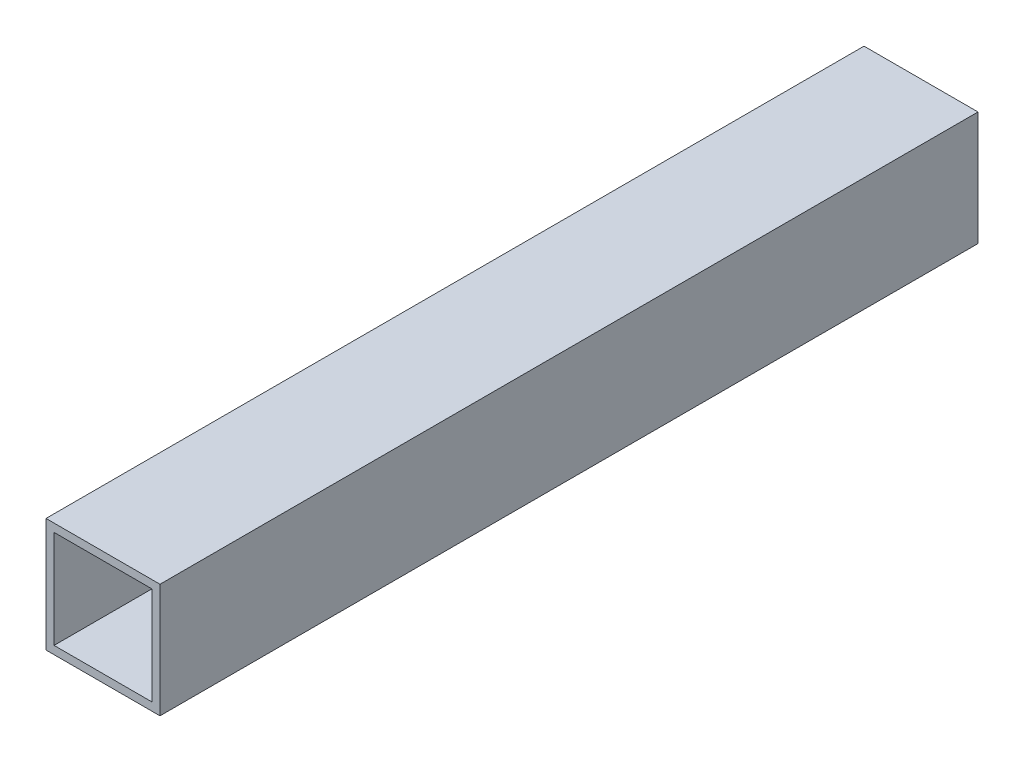
ISO-10303-21;
HEADER;
FILE_DESCRIPTION(('STEP AP214'),'2;1');
FILE_NAME('part.step','',(''),(''),'','','');
FILE_SCHEMA(('AUTOMOTIVE_DESIGN { 1 0 10303 214 1 1 1 1 }'));
ENDSEC;
DATA;
#1=APPLICATION_CONTEXT('core data for automotive mechanical design processes');
#2=APPLICATION_PROTOCOL_DEFINITION('international standard','automotive_design',2000,#1);
#3=PRODUCT_CONTEXT('',#1,'mechanical');
#4=PRODUCT('Part','Part','',(#3));
#5=PRODUCT_RELATED_PRODUCT_CATEGORY('part','',(#4));
#6=PRODUCT_DEFINITION_FORMATION('','',#4);
#7=PRODUCT_DEFINITION_CONTEXT('part definition',#1,'design');
#8=PRODUCT_DEFINITION('design','',#6,#7);
#9=PRODUCT_DEFINITION_SHAPE('','',#8);
#10=(LENGTH_UNIT() NAMED_UNIT(*) SI_UNIT(.MILLI.,.METRE.));
#11=(NAMED_UNIT(*) PLANE_ANGLE_UNIT() SI_UNIT($,.RADIAN.));
#12=(NAMED_UNIT(*) SI_UNIT($,.STERADIAN.) SOLID_ANGLE_UNIT());
#13=UNCERTAINTY_MEASURE_WITH_UNIT(LENGTH_MEASURE(1.E-05),#10,'distance_accuracy_value','');
#14=(GEOMETRIC_REPRESENTATION_CONTEXT(3) GLOBAL_UNCERTAINTY_ASSIGNED_CONTEXT((#13)) GLOBAL_UNIT_ASSIGNED_CONTEXT((#10,
#11,#12)) REPRESENTATION_CONTEXT('',''));
#15=CARTESIAN_POINT('',(0.,0.,0.));
#16=DIRECTION('',(0.,0.,1.));
#17=DIRECTION('',(1.,0.,0.));
#18=AXIS2_PLACEMENT_3D('',#15,#16,#17);
#19=CARTESIAN_POINT('',(0.,0.,122.));
#20=DIRECTION('',(0.,0.,-1.));
#21=DIRECTION('',(-1.,0.,0.));
#22=AXIS2_PLACEMENT_3D('',#19,#20,#21);
#23=PLANE('',#22);
#24=DIRECTION('',(0.,1.,0.));
#25=VECTOR('',#24,1.);
#26=CARTESIAN_POINT('',(8.5,-8.5,122.));
#27=LINE('',#26,#25);
#28=CARTESIAN_POINT('',(8.5,-8.5,122.));
#29=VERTEX_POINT('',#28);
#30=CARTESIAN_POINT('',(8.5,8.5,122.));
#31=VERTEX_POINT('',#30);
#32=EDGE_CURVE('E153',#29,#31,#27,.T.);
#33=ORIENTED_EDGE('',*,*,#32,.T.);
#34=DIRECTION('',(-1.,0.,0.));
#35=VECTOR('',#34,1.);
#36=CARTESIAN_POINT('',(-8.5,8.5,122.));
#37=LINE('',#36,#35);
#38=CARTESIAN_POINT('',(-8.5,8.5,122.));
#39=VERTEX_POINT('',#38);
#40=EDGE_CURVE('E157',#31,#39,#37,.T.);
#41=ORIENTED_EDGE('',*,*,#40,.T.);
#42=DIRECTION('',(0.,-1.,0.));
#43=VECTOR('',#42,1.);
#44=CARTESIAN_POINT('',(-8.5,-8.5,122.));
#45=LINE('',#44,#43);
#46=CARTESIAN_POINT('',(-8.5,-8.5,122.));
#47=VERTEX_POINT('',#46);
#48=EDGE_CURVE('E161',#39,#47,#45,.T.);
#49=ORIENTED_EDGE('',*,*,#48,.T.);
#50=DIRECTION('',(1.,0.,0.));
#51=VECTOR('',#50,1.);
#52=CARTESIAN_POINT('',(-8.5,-8.5,122.));
#53=LINE('',#52,#51);
#54=EDGE_CURVE('E164',#47,#29,#53,.T.);
#55=ORIENTED_EDGE('',*,*,#54,.T.);
#56=EDGE_LOOP('',(#33,#41,#49,#55));
#57=FACE_BOUND('',#56,.T.);
#58=DIRECTION('',(0.,-1.,0.));
#59=VECTOR('',#58,1.);
#60=CARTESIAN_POINT('',(-7.3,-7.3,122.));
#61=LINE('',#60,#59);
#62=CARTESIAN_POINT('',(-7.3,7.3,122.));
#63=VERTEX_POINT('',#62);
#64=CARTESIAN_POINT('',(-7.3,-7.3,122.));
#65=VERTEX_POINT('',#64);
#66=EDGE_CURVE('E105',#63,#65,#61,.T.);
#67=ORIENTED_EDGE('',*,*,#66,.F.);
#68=DIRECTION('',(-1.,0.,0.));
#69=VECTOR('',#68,1.);
#70=CARTESIAN_POINT('',(-7.3,7.3,122.));
#71=LINE('',#70,#69);
#72=CARTESIAN_POINT('',(7.3,7.3,122.));
#73=VERTEX_POINT('',#72);
#74=EDGE_CURVE('E131',#73,#63,#71,.T.);
#75=ORIENTED_EDGE('',*,*,#74,.F.);
#76=DIRECTION('',(0.,1.,0.));
#77=VECTOR('',#76,1.);
#78=CARTESIAN_POINT('',(7.3,-7.3,122.));
#79=LINE('',#78,#77);
#80=CARTESIAN_POINT('',(7.3,-7.3,122.));
#81=VERTEX_POINT('',#80);
#82=EDGE_CURVE('E127',#81,#73,#79,.T.);
#83=ORIENTED_EDGE('',*,*,#82,.F.);
#84=DIRECTION('',(1.,0.,0.));
#85=VECTOR('',#84,1.);
#86=CARTESIAN_POINT('',(-7.3,-7.3,122.));
#87=LINE('',#86,#85);
#88=EDGE_CURVE('E114',#65,#81,#87,.T.);
#89=ORIENTED_EDGE('',*,*,#88,.F.);
#90=EDGE_LOOP('',(#67,#75,#83,#89));
#91=FACE_BOUND('',#90,.T.);
#92=ADVANCED_FACE('F39',(#57,#91),#23,.F.);
#93=CARTESIAN_POINT('',(0.,0.,0.));
#94=DIRECTION('',(0.,0.,-1.));
#95=DIRECTION('',(-1.,0.,0.));
#96=AXIS2_PLACEMENT_3D('',#93,#94,#95);
#97=PLANE('',#96);
#98=DIRECTION('',(0.,1.,0.));
#99=VECTOR('',#98,1.);
#100=CARTESIAN_POINT('',(8.5,-8.5,0.));
#101=LINE('',#100,#99);
#102=CARTESIAN_POINT('',(8.5,-8.5,0.));
#103=VERTEX_POINT('',#102);
#104=CARTESIAN_POINT('',(8.5,8.5,0.));
#105=VERTEX_POINT('',#104);
#106=EDGE_CURVE('E123',#103,#105,#101,.T.);
#107=ORIENTED_EDGE('',*,*,#106,.F.);
#108=DIRECTION('',(1.,0.,0.));
#109=VECTOR('',#108,1.);
#110=CARTESIAN_POINT('',(-8.5,-8.5,0.));
#111=LINE('',#110,#109);
#112=CARTESIAN_POINT('',(-8.5,-8.5,0.));
#113=VERTEX_POINT('',#112);
#114=EDGE_CURVE('E158',#113,#103,#111,.T.);
#115=ORIENTED_EDGE('',*,*,#114,.F.);
#116=DIRECTION('',(0.,-1.,0.));
#117=VECTOR('',#116,1.);
#118=CARTESIAN_POINT('',(-8.5,-8.5,0.));
#119=LINE('',#118,#117);
#120=CARTESIAN_POINT('',(-8.5,8.5,0.));
#121=VERTEX_POINT('',#120);
#122=EDGE_CURVE('E174',#121,#113,#119,.T.);
#123=ORIENTED_EDGE('',*,*,#122,.F.);
#124=DIRECTION('',(-1.,0.,0.));
#125=VECTOR('',#124,1.);
#126=CARTESIAN_POINT('',(-8.5,8.5,0.));
#127=LINE('',#126,#125);
#128=EDGE_CURVE('E171',#105,#121,#127,.T.);
#129=ORIENTED_EDGE('',*,*,#128,.F.);
#130=EDGE_LOOP('',(#107,#115,#123,#129));
#131=FACE_BOUND('',#130,.T.);
#132=DIRECTION('',(-1.,0.,0.));
#133=VECTOR('',#132,1.);
#134=CARTESIAN_POINT('',(-7.3,7.3,0.));
#135=LINE('',#134,#133);
#136=CARTESIAN_POINT('',(7.3,7.3,0.));
#137=VERTEX_POINT('',#136);
#138=CARTESIAN_POINT('',(-7.3,7.3,0.));
#139=VERTEX_POINT('',#138);
#140=EDGE_CURVE('E115',#137,#139,#135,.T.);
#141=ORIENTED_EDGE('',*,*,#140,.T.);
#142=DIRECTION('',(0.,-1.,0.));
#143=VECTOR('',#142,1.);
#144=CARTESIAN_POINT('',(-7.3,-7.3,0.));
#145=LINE('',#144,#143);
#146=CARTESIAN_POINT('',(-7.3,-7.3,0.));
#147=VERTEX_POINT('',#146);
#148=EDGE_CURVE('E63',#139,#147,#145,.T.);
#149=ORIENTED_EDGE('',*,*,#148,.T.);
#150=DIRECTION('',(1.,0.,0.));
#151=VECTOR('',#150,1.);
#152=CARTESIAN_POINT('',(-7.3,-7.3,0.));
#153=LINE('',#152,#151);
#154=CARTESIAN_POINT('',(7.3,-7.3,0.));
#155=VERTEX_POINT('',#154);
#156=EDGE_CURVE('E121',#147,#155,#153,.T.);
#157=ORIENTED_EDGE('',*,*,#156,.T.);
#158=DIRECTION('',(0.,1.,0.));
#159=VECTOR('',#158,1.);
#160=CARTESIAN_POINT('',(7.3,-7.3,0.));
#161=LINE('',#160,#159);
#162=EDGE_CURVE('E140',#155,#137,#161,.T.);
#163=ORIENTED_EDGE('',*,*,#162,.T.);
#164=EDGE_LOOP('',(#141,#149,#157,#163));
#165=FACE_BOUND('',#164,.T.);
#166=ADVANCED_FACE('F197',(#131,#165),#97,.T.);
#167=CARTESIAN_POINT('',(8.5,-8.5,122.));
#168=DIRECTION('',(-1.,0.,0.));
#169=DIRECTION('',(0.,0.,1.));
#170=AXIS2_PLACEMENT_3D('',#167,#168,#169);
#171=PLANE('',#170);
#172=ORIENTED_EDGE('',*,*,#106,.T.);
#173=DIRECTION('',(0.,0.,-1.));
#174=VECTOR('',#173,1.);
#175=CARTESIAN_POINT('',(8.5,8.5,122.));
#176=LINE('',#175,#174);
#177=EDGE_CURVE('E11',#31,#105,#176,.T.);
#178=ORIENTED_EDGE('',*,*,#177,.F.);
#179=ORIENTED_EDGE('',*,*,#32,.F.);
#180=DIRECTION('',(0.,0.,-1.));
#181=VECTOR('',#180,1.);
#182=CARTESIAN_POINT('',(8.5,-8.5,122.));
#183=LINE('',#182,#181);
#184=EDGE_CURVE('E167',#29,#103,#183,.T.);
#185=ORIENTED_EDGE('',*,*,#184,.T.);
#186=EDGE_LOOP('',(#172,#178,#179,#185));
#187=FACE_BOUND('',#186,.T.);
#188=ADVANCED_FACE('F41',(#187),#171,.F.);
#189=CARTESIAN_POINT('',(-8.5,8.5,122.));
#190=DIRECTION('',(0.,-1.,0.));
#191=DIRECTION('',(0.,0.,-1.));
#192=AXIS2_PLACEMENT_3D('',#189,#190,#191);
#193=PLANE('',#192);
#194=ORIENTED_EDGE('',*,*,#128,.T.);
#195=DIRECTION('',(0.,0.,-1.));
#196=VECTOR('',#195,1.);
#197=CARTESIAN_POINT('',(-8.5,8.5,122.));
#198=LINE('',#197,#196);
#199=EDGE_CURVE('E48',#39,#121,#198,.T.);
#200=ORIENTED_EDGE('',*,*,#199,.F.);
#201=ORIENTED_EDGE('',*,*,#40,.F.);
#202=ORIENTED_EDGE('',*,*,#177,.T.);
#203=EDGE_LOOP('',(#194,#200,#201,#202));
#204=FACE_BOUND('',#203,.T.);
#205=ADVANCED_FACE('F207',(#204),#193,.F.);
#206=CARTESIAN_POINT('',(-8.5,-8.5,122.));
#207=DIRECTION('',(1.,0.,0.));
#208=DIRECTION('',(0.,0.,-1.));
#209=AXIS2_PLACEMENT_3D('',#206,#207,#208);
#210=PLANE('',#209);
#211=ORIENTED_EDGE('',*,*,#122,.T.);
#212=DIRECTION('',(0.,0.,-1.));
#213=VECTOR('',#212,1.);
#214=CARTESIAN_POINT('',(-8.5,-8.5,122.));
#215=LINE('',#214,#213);
#216=EDGE_CURVE('E182',#47,#113,#215,.T.);
#217=ORIENTED_EDGE('',*,*,#216,.F.);
#218=ORIENTED_EDGE('',*,*,#48,.F.);
#219=ORIENTED_EDGE('',*,*,#199,.T.);
#220=EDGE_LOOP('',(#211,#217,#218,#219));
#221=FACE_BOUND('',#220,.T.);
#222=ADVANCED_FACE('F191',(#221),#210,.F.);
#223=CARTESIAN_POINT('',(-8.5,-8.5,122.));
#224=DIRECTION('',(0.,1.,0.));
#225=DIRECTION('',(0.,0.,1.));
#226=AXIS2_PLACEMENT_3D('',#223,#224,#225);
#227=PLANE('',#226);
#228=ORIENTED_EDGE('',*,*,#114,.T.);
#229=ORIENTED_EDGE('',*,*,#184,.F.);
#230=ORIENTED_EDGE('',*,*,#54,.F.);
#231=ORIENTED_EDGE('',*,*,#216,.T.);
#232=EDGE_LOOP('',(#228,#229,#230,#231));
#233=FACE_BOUND('',#232,.T.);
#234=ADVANCED_FACE('F201',(#233),#227,.F.);
#235=CARTESIAN_POINT('',(-7.3,-7.3,122.));
#236=DIRECTION('',(1.,0.,0.));
#237=DIRECTION('',(0.,0.,-1.));
#238=AXIS2_PLACEMENT_3D('',#235,#236,#237);
#239=PLANE('',#238);
#240=ORIENTED_EDGE('',*,*,#148,.F.);
#241=DIRECTION('',(0.,0.,-1.));
#242=VECTOR('',#241,1.);
#243=CARTESIAN_POINT('',(-7.3,7.3,122.));
#244=LINE('',#243,#242);
#245=EDGE_CURVE('E109',#63,#139,#244,.T.);
#246=ORIENTED_EDGE('',*,*,#245,.F.);
#247=ORIENTED_EDGE('',*,*,#66,.T.);
#248=DIRECTION('',(0.,0.,-1.));
#249=VECTOR('',#248,1.);
#250=CARTESIAN_POINT('',(-7.3,-7.3,122.));
#251=LINE('',#250,#249);
#252=EDGE_CURVE('E108',#65,#147,#251,.T.);
#253=ORIENTED_EDGE('',*,*,#252,.T.);
#254=EDGE_LOOP('',(#240,#246,#247,#253));
#255=FACE_BOUND('',#254,.T.);
#256=ADVANCED_FACE('F107',(#255),#239,.T.);
#257=CARTESIAN_POINT('',(-7.3,-7.3,122.));
#258=DIRECTION('',(0.,1.,0.));
#259=DIRECTION('',(0.,0.,1.));
#260=AXIS2_PLACEMENT_3D('',#257,#258,#259);
#261=PLANE('',#260);
#262=ORIENTED_EDGE('',*,*,#156,.F.);
#263=ORIENTED_EDGE('',*,*,#252,.F.);
#264=ORIENTED_EDGE('',*,*,#88,.T.);
#265=DIRECTION('',(0.,0.,-1.));
#266=VECTOR('',#265,1.);
#267=CARTESIAN_POINT('',(7.3,-7.3,122.));
#268=LINE('',#267,#266);
#269=EDGE_CURVE('E124',#81,#155,#268,.T.);
#270=ORIENTED_EDGE('',*,*,#269,.T.);
#271=EDGE_LOOP('',(#262,#263,#264,#270));
#272=FACE_BOUND('',#271,.T.);
#273=ADVANCED_FACE('F118',(#272),#261,.T.);
#274=CARTESIAN_POINT('',(7.3,-7.3,122.));
#275=DIRECTION('',(-1.,0.,0.));
#276=DIRECTION('',(0.,0.,1.));
#277=AXIS2_PLACEMENT_3D('',#274,#275,#276);
#278=PLANE('',#277);
#279=ORIENTED_EDGE('',*,*,#162,.F.);
#280=ORIENTED_EDGE('',*,*,#269,.F.);
#281=ORIENTED_EDGE('',*,*,#82,.T.);
#282=DIRECTION('',(0.,0.,-1.));
#283=VECTOR('',#282,1.);
#284=CARTESIAN_POINT('',(7.3,7.3,122.));
#285=LINE('',#284,#283);
#286=EDGE_CURVE('E55',#73,#137,#285,.T.);
#287=ORIENTED_EDGE('',*,*,#286,.T.);
#288=EDGE_LOOP('',(#279,#280,#281,#287));
#289=FACE_BOUND('',#288,.T.);
#290=ADVANCED_FACE('F230',(#289),#278,.T.);
#291=CARTESIAN_POINT('',(-7.3,7.3,122.));
#292=DIRECTION('',(0.,-1.,0.));
#293=DIRECTION('',(1.,0.,0.));
#294=AXIS2_PLACEMENT_3D('',#291,#292,#293);
#295=PLANE('',#294);
#296=ORIENTED_EDGE('',*,*,#140,.F.);
#297=ORIENTED_EDGE('',*,*,#286,.F.);
#298=ORIENTED_EDGE('',*,*,#74,.T.);
#299=ORIENTED_EDGE('',*,*,#245,.T.);
#300=EDGE_LOOP('',(#296,#297,#298,#299));
#301=FACE_BOUND('',#300,.T.);
#302=ADVANCED_FACE('F234',(#301),#295,.T.);
#303=CLOSED_SHELL('',(#92,#166,#188,#205,#222,#234,#256,#273,#290,#302));
#304=MANIFOLD_SOLID_BREP('B2',#303);
#305=ADVANCED_BREP_SHAPE_REPRESENTATION('',(#18,#304),#14);
#306=SHAPE_DEFINITION_REPRESENTATION(#9,#305);
ENDSEC;
END-ISO-10303-21;
